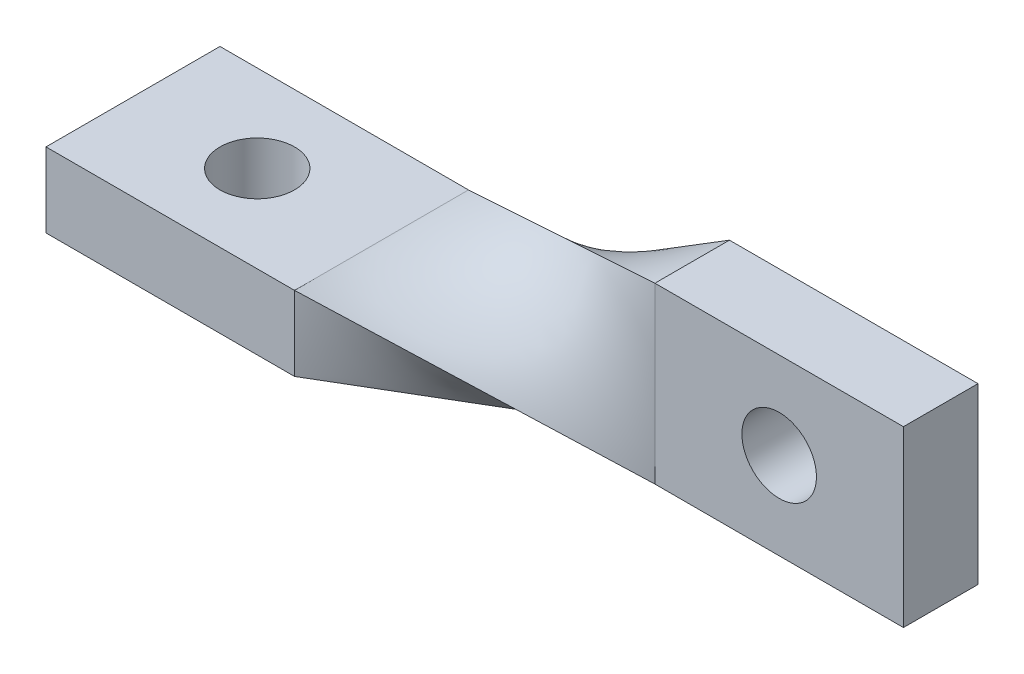
ISO-10303-21;
HEADER;
FILE_DESCRIPTION(('STEP AP214'),'2;1');
FILE_NAME('part.step','',(''),(''),'','','');
FILE_SCHEMA(('AUTOMOTIVE_DESIGN { 1 0 10303 214 1 1 1 1 }'));
ENDSEC;
DATA;
#1=APPLICATION_CONTEXT('core data for automotive mechanical design processes');
#2=APPLICATION_PROTOCOL_DEFINITION('international standard','automotive_design',2000,#1);
#3=PRODUCT_CONTEXT('',#1,'mechanical');
#4=PRODUCT('Part','Part','',(#3));
#5=PRODUCT_RELATED_PRODUCT_CATEGORY('part','',(#4));
#6=PRODUCT_DEFINITION_FORMATION('','',#4);
#7=PRODUCT_DEFINITION_CONTEXT('part definition',#1,'design');
#8=PRODUCT_DEFINITION('design','',#6,#7);
#9=PRODUCT_DEFINITION_SHAPE('','',#8);
#10=(LENGTH_UNIT() NAMED_UNIT(*) SI_UNIT(.MILLI.,.METRE.));
#11=(NAMED_UNIT(*) PLANE_ANGLE_UNIT() SI_UNIT($,.RADIAN.));
#12=(NAMED_UNIT(*) SI_UNIT($,.STERADIAN.) SOLID_ANGLE_UNIT());
#13=UNCERTAINTY_MEASURE_WITH_UNIT(LENGTH_MEASURE(1.E-05),#10,'distance_accuracy_value','');
#14=(GEOMETRIC_REPRESENTATION_CONTEXT(3) GLOBAL_UNCERTAINTY_ASSIGNED_CONTEXT((#13)) GLOBAL_UNIT_ASSIGNED_CONTEXT((#10,
#11,#12)) REPRESENTATION_CONTEXT('',''));
#15=CARTESIAN_POINT('',(0.,0.,0.));
#16=DIRECTION('',(0.,0.,1.));
#17=DIRECTION('',(1.,0.,0.));
#18=AXIS2_PLACEMENT_3D('',#15,#16,#17);
#19=CARTESIAN_POINT('',(9.,3.5,-5.));
#20=CARTESIAN_POINT('',(6.,1.83333333333333,-4.5));
#21=CARTESIAN_POINT('',(3.,0.166666666666668,-4.));
#22=CARTESIAN_POINT('',(0.,-1.5,-3.49999999999999));
#23=CARTESIAN_POINT('',(9.,1.16666666666667,-5.));
#24=CARTESIAN_POINT('',(6.,0.277777777777778,-3.72222222222222));
#25=CARTESIAN_POINT('',(3.,-0.61111111111111,-2.44444444444444));
#26=CARTESIAN_POINT('',(0.,-1.5,-1.16666666666666));
#27=CARTESIAN_POINT('',(9.,-1.16666666666667,-5.));
#28=CARTESIAN_POINT('',(6.,-1.27777777777778,-2.94444444444444));
#29=CARTESIAN_POINT('',(3.,-1.38888888888889,-0.888888888888886));
#30=CARTESIAN_POINT('',(0.,-1.5,1.16666666666667));
#31=CARTESIAN_POINT('',(9.,-3.5,-5.));
#32=CARTESIAN_POINT('',(6.,-2.83333333333333,-2.16666666666667));
#33=CARTESIAN_POINT('',(3.,-2.16666666666667,0.666666666666669));
#34=CARTESIAN_POINT('',(0.,-1.5,3.50000000000001));
#35=B_SPLINE_SURFACE_WITH_KNOTS('',3,3,((#19,#20,#21,#22),(#23,#24,#25,#26),(#27,#28,#29,#30),
(#31,#32,#33,#34)),.UNSPECIFIED.,.F.,.F.,.F.,(4,4),(4,4),(0.,1.),(0.,1.),.UNSPECIFIED.);
#36=DIRECTION('',(0.,1.,0.));
#37=VECTOR('',#36,1.);
#38=CARTESIAN_POINT('',(9.,-3.5,-5.));
#39=LINE('',#38,#37);
#40=CARTESIAN_POINT('',(9.,-3.5,-5.));
#41=VERTEX_POINT('',#40);
#42=CARTESIAN_POINT('',(9.,3.5,-5.));
#43=VERTEX_POINT('',#42);
#44=EDGE_CURVE('E230',#41,#43,#39,.T.);
#45=DIRECTION('',(-0.71770700054601,0.15949044456578,0.677834389404565));
#46=VECTOR('',#45,1.);
#47=CARTESIAN_POINT('',(4.5,-2.5,-0.749999999999999));
#48=LINE('',#47,#46);
#49=CARTESIAN_POINT('',(0.,-1.5,3.50000000000001));
#50=VERTEX_POINT('',#49);
#51=EDGE_CURVE('E96',#41,#50,#48,.T.);
#52=DIRECTION('',(0.,0.,1.));
#53=VECTOR('',#52,1.);
#54=CARTESIAN_POINT('',(0.,-1.5,3.50000000000001));
#55=LINE('',#54,#53);
#56=CARTESIAN_POINT('',(0.,-1.5,-3.49999999999999));
#57=VERTEX_POINT('',#56);
#58=EDGE_CURVE('E88',#57,#50,#55,.T.);
#59=DIRECTION('',(0.865024796397983,0.480569331332212,-0.144170799399664));
#60=VECTOR('',#59,1.);
#61=CARTESIAN_POINT('',(4.5,1.,-4.25));
#62=LINE('',#61,#60);
#63=EDGE_CURVE('E293',#57,#43,#62,.T.);
#64=ORIENTED_EDGE('',*,*,#44,.F.);
#65=ORIENTED_EDGE('',*,*,#51,.T.);
#66=ORIENTED_EDGE('',*,*,#58,.F.);
#67=ORIENTED_EDGE('',*,*,#63,.T.);
#68=EDGE_LOOP('',(#64,#65,#66,#67));
#69=FACE_BOUND('',#68,.T.);
#70=ADVANCED_FACE('F75',(#69),#35,.T.);
#71=CARTESIAN_POINT('',(9.,-3.5,-5.));
#72=CARTESIAN_POINT('',(6.,-2.83333333333333,-2.16666666666667));
#73=CARTESIAN_POINT('',(3.,-2.16666666666667,0.666666666666669));
#74=CARTESIAN_POINT('',(0.,-1.5,3.50000000000001));
#75=CARTESIAN_POINT('',(9.,-3.5,-4.));
#76=CARTESIAN_POINT('',(6.,-2.5,-1.5));
#77=CARTESIAN_POINT('',(3.,-1.5,1.));
#78=CARTESIAN_POINT('',(0.,-0.499999999999998,3.50000000000001));
#79=CARTESIAN_POINT('',(9.,-3.5,-3.));
#80=CARTESIAN_POINT('',(6.,-2.16666666666667,-0.833333333333334));
#81=CARTESIAN_POINT('',(3.,-0.833333333333333,1.33333333333334));
#82=CARTESIAN_POINT('',(0.,0.500000000000002,3.50000000000001));
#83=CARTESIAN_POINT('',(9.,-3.5,-2.));
#84=CARTESIAN_POINT('',(6.,-1.83333333333333,-0.166666666666667));
#85=CARTESIAN_POINT('',(3.,-0.166666666666666,1.66666666666667));
#86=CARTESIAN_POINT('',(0.,1.5,3.50000000000001));
#87=B_SPLINE_SURFACE_WITH_KNOTS('',3,3,((#71,#72,#73,#74),(#75,#76,#77,#78),(#79,#80,#81,#82),
(#83,#84,#85,#86)),.UNSPECIFIED.,.F.,.F.,.F.,(4,4),(4,4),(0.,1.),(0.,1.),.UNSPECIFIED.);
#88=DIRECTION('',(0.,0.,-1.));
#89=VECTOR('',#88,1.);
#90=CARTESIAN_POINT('',(9.,-3.5,-2.));
#91=LINE('',#90,#89);
#92=CARTESIAN_POINT('',(9.,-3.5,-2.));
#93=VERTEX_POINT('',#92);
#94=EDGE_CURVE('E181',#93,#41,#91,.T.);
#95=DIRECTION('',(-0.771035286380614,0.428352936878119,0.471188230565932));
#96=VECTOR('',#95,1.);
#97=CARTESIAN_POINT('',(4.5,-1.,0.750000000000001));
#98=LINE('',#97,#96);
#99=CARTESIAN_POINT('',(0.,1.5,3.50000000000001));
#100=VERTEX_POINT('',#99);
#101=EDGE_CURVE('E314',#93,#100,#98,.T.);
#102=DIRECTION('',(0.,1.,0.));
#103=VECTOR('',#102,1.);
#104=CARTESIAN_POINT('',(0.,-1.5,3.50000000000001));
#105=LINE('',#104,#103);
#106=EDGE_CURVE('E13',#50,#100,#105,.T.);
#107=ORIENTED_EDGE('',*,*,#94,.F.);
#108=ORIENTED_EDGE('',*,*,#101,.T.);
#109=ORIENTED_EDGE('',*,*,#106,.F.);
#110=ORIENTED_EDGE('',*,*,#51,.F.);
#111=EDGE_LOOP('',(#107,#108,#109,#110));
#112=FACE_BOUND('',#111,.T.);
#113=ADVANCED_FACE('F343',(#112),#87,.T.);
#114=CARTESIAN_POINT('',(9.,3.5,-2.));
#115=CARTESIAN_POINT('',(6.,2.83333333333333,-2.5));
#116=CARTESIAN_POINT('',(3.,2.16666666666667,-3.));
#117=CARTESIAN_POINT('',(0.,1.5,-3.49999999999999));
#118=CARTESIAN_POINT('',(9.,3.5,-3.));
#119=CARTESIAN_POINT('',(6.,2.5,-3.16666666666666));
#120=CARTESIAN_POINT('',(3.,1.5,-3.33333333333333));
#121=CARTESIAN_POINT('',(0.,0.500000000000002,-3.49999999999999));
#122=CARTESIAN_POINT('',(9.,3.5,-4.));
#123=CARTESIAN_POINT('',(6.,2.16666666666667,-3.83333333333333));
#124=CARTESIAN_POINT('',(3.,0.833333333333334,-3.66666666666666));
#125=CARTESIAN_POINT('',(0.,-0.499999999999998,-3.49999999999999));
#126=CARTESIAN_POINT('',(9.,3.5,-5.));
#127=CARTESIAN_POINT('',(6.,1.83333333333333,-4.5));
#128=CARTESIAN_POINT('',(3.,0.166666666666668,-4.));
#129=CARTESIAN_POINT('',(0.,-1.5,-3.49999999999999));
#130=B_SPLINE_SURFACE_WITH_KNOTS('',3,3,((#114,#115,#116,#117),(#118,#119,#120,#121),(#122,#123,
#124,#125),(#126,#127,#128,#129)),.UNSPECIFIED.,.F.,.F.,.F.,(4,4),(4,4),(0.,1.),(0.,1.),.UNSPECIFIED.);
#131=DIRECTION('',(0.,0.,1.));
#132=VECTOR('',#131,1.);
#133=CARTESIAN_POINT('',(9.,3.5,-2.));
#134=LINE('',#133,#132);
#135=CARTESIAN_POINT('',(9.,3.5,-2.));
#136=VERTEX_POINT('',#135);
#137=EDGE_CURVE('E221',#43,#136,#134,.T.);
#138=DIRECTION('',(0.,-1.,0.));
#139=VECTOR('',#138,1.);
#140=CARTESIAN_POINT('',(0.,-1.5,-3.49999999999999));
#141=LINE('',#140,#139);
#142=CARTESIAN_POINT('',(0.,1.5,-3.49999999999999));
#143=VERTEX_POINT('',#142);
#144=EDGE_CURVE('E104',#143,#57,#141,.T.);
#145=DIRECTION('',(-0.963517909629941,-0.214115091028875,-0.160586318271657));
#146=VECTOR('',#145,1.);
#147=CARTESIAN_POINT('',(4.5,2.5,-2.75));
#148=LINE('',#147,#146);
#149=EDGE_CURVE('E321',#136,#143,#148,.T.);
#150=ORIENTED_EDGE('',*,*,#137,.F.);
#151=ORIENTED_EDGE('',*,*,#63,.F.);
#152=ORIENTED_EDGE('',*,*,#144,.F.);
#153=ORIENTED_EDGE('',*,*,#149,.F.);
#154=EDGE_LOOP('',(#150,#151,#152,#153));
#155=FACE_BOUND('',#154,.T.);
#156=ADVANCED_FACE('F333',(#155),#130,.T.);
#157=CARTESIAN_POINT('',(9.,-3.5,-2.));
#158=CARTESIAN_POINT('',(6.,-1.83333333333333,-0.166666666666667));
#159=CARTESIAN_POINT('',(3.,-0.166666666666666,1.66666666666667));
#160=CARTESIAN_POINT('',(0.,1.5,3.50000000000001));
#161=CARTESIAN_POINT('',(9.,-1.16666666666667,-2.));
#162=CARTESIAN_POINT('',(6.,-0.277777777777779,-0.944444444444444));
#163=CARTESIAN_POINT('',(3.,0.611111111111111,0.111111111111114));
#164=CARTESIAN_POINT('',(0.,1.5,1.16666666666667));
#165=CARTESIAN_POINT('',(9.,1.16666666666666,-2.));
#166=CARTESIAN_POINT('',(6.,1.27777777777778,-1.72222222222222));
#167=CARTESIAN_POINT('',(3.,1.38888888888889,-1.44444444444444));
#168=CARTESIAN_POINT('',(0.,1.5,-1.16666666666666));
#169=CARTESIAN_POINT('',(9.,3.5,-2.));
#170=CARTESIAN_POINT('',(6.,2.83333333333333,-2.5));
#171=CARTESIAN_POINT('',(3.,2.16666666666667,-3.));
#172=CARTESIAN_POINT('',(0.,1.5,-3.49999999999999));
#173=B_SPLINE_SURFACE_WITH_KNOTS('',3,3,((#157,#158,#159,#160),(#161,#162,#163,#164),(#165,#166,
#167,#168),(#169,#170,#171,#172)),.UNSPECIFIED.,.F.,.F.,.F.,(4,4),(4,4),(0.,1.),(0.,1.),.UNSPECIFIED.);
#174=DIRECTION('',(0.,-1.,0.));
#175=VECTOR('',#174,1.);
#176=CARTESIAN_POINT('',(9.,-3.5,-2.));
#177=LINE('',#176,#175);
#178=EDGE_CURVE('E229',#136,#93,#177,.T.);
#179=DIRECTION('',(0.,0.,-1.));
#180=VECTOR('',#179,1.);
#181=CARTESIAN_POINT('',(0.,1.5,3.50000000000001));
#182=LINE('',#181,#180);
#183=EDGE_CURVE('E82',#100,#143,#182,.T.);
#184=ORIENTED_EDGE('',*,*,#178,.F.);
#185=ORIENTED_EDGE('',*,*,#149,.T.);
#186=ORIENTED_EDGE('',*,*,#183,.F.);
#187=ORIENTED_EDGE('',*,*,#101,.F.);
#188=EDGE_LOOP('',(#184,#185,#186,#187));
#189=FACE_BOUND('',#188,.T.);
#190=ADVANCED_FACE('F77',(#189),#173,.T.);
#191=CARTESIAN_POINT('',(19.,3.5,-2.));
#192=DIRECTION('',(0.,0.,-1.));
#193=DIRECTION('',(0.,1.,0.));
#194=AXIS2_PLACEMENT_3D('',#191,#192,#193);
#195=PLANE('',#194);
#196=CARTESIAN_POINT('',(14.,0.,-2.));
#197=DIRECTION('',(0.,0.,1.));
#198=DIRECTION('',(1.,0.,0.));
#199=AXIS2_PLACEMENT_3D('',#196,#197,#198);
#200=CIRCLE('',#199,1.5);
#201=CARTESIAN_POINT('',(15.5,0.,-2.));
#202=VERTEX_POINT('',#201);
#203=EDGE_CURVE('E559',#202,#202,#200,.T.);
#204=ORIENTED_EDGE('',*,*,#203,.F.);
#205=EDGE_LOOP('',(#204));
#206=FACE_BOUND('',#205,.T.);
#207=ORIENTED_EDGE('',*,*,#178,.T.);
#208=DIRECTION('',(-1.,0.,0.));
#209=VECTOR('',#208,1.);
#210=CARTESIAN_POINT('',(19.,-3.5,-2.));
#211=LINE('',#210,#209);
#212=CARTESIAN_POINT('',(19.,-3.5,-2.));
#213=VERTEX_POINT('',#212);
#214=EDGE_CURVE('E252',#213,#93,#211,.T.);
#215=ORIENTED_EDGE('',*,*,#214,.F.);
#216=DIRECTION('',(0.,-1.,0.));
#217=VECTOR('',#216,1.);
#218=CARTESIAN_POINT('',(19.,3.5,-2.));
#219=LINE('',#218,#217);
#220=CARTESIAN_POINT('',(19.,3.5,-2.));
#221=VERTEX_POINT('',#220);
#222=EDGE_CURVE('E172',#221,#213,#219,.T.);
#223=ORIENTED_EDGE('',*,*,#222,.F.);
#224=DIRECTION('',(-1.,0.,0.));
#225=VECTOR('',#224,1.);
#226=CARTESIAN_POINT('',(19.,3.5,-2.));
#227=LINE('',#226,#225);
#228=EDGE_CURVE('E294',#221,#136,#227,.T.);
#229=ORIENTED_EDGE('',*,*,#228,.T.);
#230=EDGE_LOOP('',(#207,#215,#223,#229));
#231=FACE_BOUND('',#230,.T.);
#232=ADVANCED_FACE('F271',(#206,#231),#195,.F.);
#233=CARTESIAN_POINT('',(19.,-3.5,-2.));
#234=DIRECTION('',(0.,1.,0.));
#235=DIRECTION('',(0.,0.,1.));
#236=AXIS2_PLACEMENT_3D('',#233,#234,#235);
#237=PLANE('',#236);
#238=ORIENTED_EDGE('',*,*,#94,.T.);
#239=DIRECTION('',(-1.,0.,0.));
#240=VECTOR('',#239,1.);
#241=CARTESIAN_POINT('',(19.,-3.5,-5.));
#242=LINE('',#241,#240);
#243=CARTESIAN_POINT('',(19.,-3.5,-5.));
#244=VERTEX_POINT('',#243);
#245=EDGE_CURVE('E249',#244,#41,#242,.T.);
#246=ORIENTED_EDGE('',*,*,#245,.F.);
#247=DIRECTION('',(0.,0.,-1.));
#248=VECTOR('',#247,1.);
#249=CARTESIAN_POINT('',(19.,-3.5,-2.));
#250=LINE('',#249,#248);
#251=EDGE_CURVE('E175',#213,#244,#250,.T.);
#252=ORIENTED_EDGE('',*,*,#251,.F.);
#253=ORIENTED_EDGE('',*,*,#214,.T.);
#254=EDGE_LOOP('',(#238,#246,#252,#253));
#255=FACE_BOUND('',#254,.T.);
#256=ADVANCED_FACE('F262',(#255),#237,.F.);
#257=CARTESIAN_POINT('',(19.,-3.5,-5.));
#258=DIRECTION('',(0.,0.,1.));
#259=DIRECTION('',(0.,-1.,0.));
#260=AXIS2_PLACEMENT_3D('',#257,#258,#259);
#261=PLANE('',#260);
#262=CARTESIAN_POINT('',(14.,0.,-5.));
#263=DIRECTION('',(0.,0.,1.));
#264=DIRECTION('',(0.,-1.,0.));
#265=AXIS2_PLACEMENT_3D('',#262,#263,#264);
#266=CIRCLE('',#265,1.5);
#267=CARTESIAN_POINT('',(14.,-1.50000000000001,-5.));
#268=VERTEX_POINT('',#267);
#269=EDGE_CURVE('E562',#268,#268,#266,.F.);
#270=ORIENTED_EDGE('',*,*,#269,.F.);
#271=EDGE_LOOP('',(#270));
#272=FACE_BOUND('',#271,.T.);
#273=ORIENTED_EDGE('',*,*,#44,.T.);
#274=DIRECTION('',(-1.,0.,0.));
#275=VECTOR('',#274,1.);
#276=CARTESIAN_POINT('',(19.,3.5,-5.));
#277=LINE('',#276,#275);
#278=CARTESIAN_POINT('',(19.,3.5,-5.));
#279=VERTEX_POINT('',#278);
#280=EDGE_CURVE('E231',#279,#43,#277,.T.);
#281=ORIENTED_EDGE('',*,*,#280,.F.);
#282=DIRECTION('',(0.,1.,0.));
#283=VECTOR('',#282,1.);
#284=CARTESIAN_POINT('',(19.,-3.5,-5.));
#285=LINE('',#284,#283);
#286=EDGE_CURVE('E302',#244,#279,#285,.T.);
#287=ORIENTED_EDGE('',*,*,#286,.F.);
#288=ORIENTED_EDGE('',*,*,#245,.T.);
#289=EDGE_LOOP('',(#273,#281,#287,#288));
#290=FACE_BOUND('',#289,.T.);
#291=ADVANCED_FACE('F210',(#272,#290),#261,.F.);
#292=CARTESIAN_POINT('',(19.,3.5,-5.));
#293=DIRECTION('',(0.,-1.,0.));
#294=DIRECTION('',(0.,0.,-1.));
#295=AXIS2_PLACEMENT_3D('',#292,#293,#294);
#296=PLANE('',#295);
#297=ORIENTED_EDGE('',*,*,#137,.T.);
#298=ORIENTED_EDGE('',*,*,#228,.F.);
#299=DIRECTION('',(0.,0.,1.));
#300=VECTOR('',#299,1.);
#301=CARTESIAN_POINT('',(19.,3.5,-5.));
#302=LINE('',#301,#300);
#303=EDGE_CURVE('E296',#279,#221,#302,.T.);
#304=ORIENTED_EDGE('',*,*,#303,.F.);
#305=ORIENTED_EDGE('',*,*,#280,.T.);
#306=EDGE_LOOP('',(#297,#298,#304,#305));
#307=FACE_BOUND('',#306,.T.);
#308=ADVANCED_FACE('F205',(#307),#296,.F.);
#309=CARTESIAN_POINT('',(19.,0.,0.));
#310=DIRECTION('',(1.,0.,0.));
#311=DIRECTION('',(0.,0.,-1.));
#312=AXIS2_PLACEMENT_3D('',#309,#310,#311);
#313=PLANE('',#312);
#314=ORIENTED_EDGE('',*,*,#222,.T.);
#315=ORIENTED_EDGE('',*,*,#251,.T.);
#316=ORIENTED_EDGE('',*,*,#286,.T.);
#317=ORIENTED_EDGE('',*,*,#303,.T.);
#318=EDGE_LOOP('',(#314,#315,#316,#317));
#319=FACE_BOUND('',#318,.T.);
#320=ADVANCED_FACE('F200',(#319),#313,.T.);
#321=CARTESIAN_POINT('',(-10.,-1.5,3.50000000000001));
#322=DIRECTION('',(0.,0.,-1.));
#323=DIRECTION('',(-1.,0.,0.));
#324=AXIS2_PLACEMENT_3D('',#321,#322,#323);
#325=PLANE('',#324);
#326=ORIENTED_EDGE('',*,*,#106,.T.);
#327=DIRECTION('',(1.,0.,0.));
#328=VECTOR('',#327,1.);
#329=CARTESIAN_POINT('',(-10.,1.5,3.50000000000001));
#330=LINE('',#329,#328);
#331=CARTESIAN_POINT('',(-10.,1.5,3.50000000000001));
#332=VERTEX_POINT('',#331);
#333=EDGE_CURVE('E153',#332,#100,#330,.T.);
#334=ORIENTED_EDGE('',*,*,#333,.F.);
#335=DIRECTION('',(0.,1.,0.));
#336=VECTOR('',#335,1.);
#337=CARTESIAN_POINT('',(-10.,-1.5,3.50000000000001));
#338=LINE('',#337,#336);
#339=CARTESIAN_POINT('',(-10.,-1.5,3.50000000000001));
#340=VERTEX_POINT('',#339);
#341=EDGE_CURVE('E159',#340,#332,#338,.T.);
#342=ORIENTED_EDGE('',*,*,#341,.F.);
#343=DIRECTION('',(1.,0.,0.));
#344=VECTOR('',#343,1.);
#345=CARTESIAN_POINT('',(-10.,-1.5,3.50000000000001));
#346=LINE('',#345,#344);
#347=EDGE_CURVE('E383',#340,#50,#346,.T.);
#348=ORIENTED_EDGE('',*,*,#347,.T.);
#349=EDGE_LOOP('',(#326,#334,#342,#348));
#350=FACE_BOUND('',#349,.T.);
#351=ADVANCED_FACE('F170',(#350),#325,.F.);
#352=CARTESIAN_POINT('',(-10.,1.5,3.50000000000001));
#353=DIRECTION('',(0.,-1.,0.));
#354=DIRECTION('',(0.,0.,-1.));
#355=AXIS2_PLACEMENT_3D('',#352,#353,#354);
#356=PLANE('',#355);
#357=CARTESIAN_POINT('',(-5.,1.5,0.));
#358=DIRECTION('',(0.,1.,0.));
#359=DIRECTION('',(0.,0.,1.));
#360=AXIS2_PLACEMENT_3D('',#357,#358,#359);
#361=CIRCLE('',#360,1.5);
#362=CARTESIAN_POINT('',(-5.,1.5,1.50000000000001));
#363=VERTEX_POINT('',#362);
#364=EDGE_CURVE('E563',#363,#363,#361,.T.);
#365=ORIENTED_EDGE('',*,*,#364,.F.);
#366=EDGE_LOOP('',(#365));
#367=FACE_BOUND('',#366,.T.);
#368=ORIENTED_EDGE('',*,*,#183,.T.);
#369=DIRECTION('',(1.,0.,0.));
#370=VECTOR('',#369,1.);
#371=CARTESIAN_POINT('',(-10.,1.5,-3.49999999999999));
#372=LINE('',#371,#370);
#373=CARTESIAN_POINT('',(-10.,1.5,-3.49999999999999));
#374=VERTEX_POINT('',#373);
#375=EDGE_CURVE('E155',#374,#143,#372,.T.);
#376=ORIENTED_EDGE('',*,*,#375,.F.);
#377=DIRECTION('',(0.,0.,-1.));
#378=VECTOR('',#377,1.);
#379=CARTESIAN_POINT('',(-10.,1.5,3.50000000000001));
#380=LINE('',#379,#378);
#381=EDGE_CURVE('E148',#332,#374,#380,.T.);
#382=ORIENTED_EDGE('',*,*,#381,.F.);
#383=ORIENTED_EDGE('',*,*,#333,.T.);
#384=EDGE_LOOP('',(#368,#376,#382,#383));
#385=FACE_BOUND('',#384,.T.);
#386=ADVANCED_FACE('F151',(#367,#385),#356,.F.);
#387=CARTESIAN_POINT('',(-10.,1.5,-3.49999999999999));
#388=DIRECTION('',(0.,0.,1.));
#389=DIRECTION('',(1.,0.,0.));
#390=AXIS2_PLACEMENT_3D('',#387,#388,#389);
#391=PLANE('',#390);
#392=ORIENTED_EDGE('',*,*,#144,.T.);
#393=DIRECTION('',(1.,0.,0.));
#394=VECTOR('',#393,1.);
#395=CARTESIAN_POINT('',(-10.,-1.5,-3.49999999999999));
#396=LINE('',#395,#394);
#397=CARTESIAN_POINT('',(-10.,-1.5,-3.49999999999999));
#398=VERTEX_POINT('',#397);
#399=EDGE_CURVE('E177',#398,#57,#396,.T.);
#400=ORIENTED_EDGE('',*,*,#399,.F.);
#401=DIRECTION('',(0.,-1.,0.));
#402=VECTOR('',#401,1.);
#403=CARTESIAN_POINT('',(-10.,1.5,-3.49999999999999));
#404=LINE('',#403,#402);
#405=EDGE_CURVE('E158',#374,#398,#404,.T.);
#406=ORIENTED_EDGE('',*,*,#405,.F.);
#407=ORIENTED_EDGE('',*,*,#375,.T.);
#408=EDGE_LOOP('',(#392,#400,#406,#407));
#409=FACE_BOUND('',#408,.T.);
#410=ADVANCED_FACE('F378',(#409),#391,.F.);
#411=CARTESIAN_POINT('',(-10.,-1.5,-3.49999999999999));
#412=DIRECTION('',(0.,1.,0.));
#413=DIRECTION('',(0.,0.,1.));
#414=AXIS2_PLACEMENT_3D('',#411,#412,#413);
#415=PLANE('',#414);
#416=CARTESIAN_POINT('',(-5.,-1.5,0.));
#417=DIRECTION('',(0.,1.,0.));
#418=DIRECTION('',(0.,0.,1.));
#419=AXIS2_PLACEMENT_3D('',#416,#417,#418);
#420=CIRCLE('',#419,1.5);
#421=CARTESIAN_POINT('',(-5.,-1.5,1.50000000000001));
#422=VERTEX_POINT('',#421);
#423=EDGE_CURVE('E168',#422,#422,#420,.F.);
#424=ORIENTED_EDGE('',*,*,#423,.F.);
#425=EDGE_LOOP('',(#424));
#426=FACE_BOUND('',#425,.T.);
#427=ORIENTED_EDGE('',*,*,#58,.T.);
#428=ORIENTED_EDGE('',*,*,#347,.F.);
#429=DIRECTION('',(0.,0.,1.));
#430=VECTOR('',#429,1.);
#431=CARTESIAN_POINT('',(-10.,-1.5,-3.49999999999999));
#432=LINE('',#431,#430);
#433=EDGE_CURVE('E164',#398,#340,#432,.T.);
#434=ORIENTED_EDGE('',*,*,#433,.F.);
#435=ORIENTED_EDGE('',*,*,#399,.T.);
#436=EDGE_LOOP('',(#427,#428,#434,#435));
#437=FACE_BOUND('',#436,.T.);
#438=ADVANCED_FACE('F382',(#426,#437),#415,.F.);
#439=CARTESIAN_POINT('',(-10.,0.,0.));
#440=DIRECTION('',(-1.,0.,0.));
#441=DIRECTION('',(0.,0.,1.));
#442=AXIS2_PLACEMENT_3D('',#439,#440,#441);
#443=PLANE('',#442);
#444=ORIENTED_EDGE('',*,*,#341,.T.);
#445=ORIENTED_EDGE('',*,*,#381,.T.);
#446=ORIENTED_EDGE('',*,*,#405,.T.);
#447=ORIENTED_EDGE('',*,*,#433,.T.);
#448=EDGE_LOOP('',(#444,#445,#446,#447));
#449=FACE_BOUND('',#448,.T.);
#450=ADVANCED_FACE('F162',(#449),#443,.T.);
#451=CARTESIAN_POINT('',(-5.,-3.5011,0.));
#452=DIRECTION('',(0.,1.,0.));
#453=DIRECTION('',(0.,0.,1.));
#454=AXIS2_PLACEMENT_3D('',#451,#452,#453);
#455=CYLINDRICAL_SURFACE('',#454,1.5);
#456=ORIENTED_EDGE('',*,*,#364,.T.);
#457=EDGE_LOOP('',(#456));
#458=FACE_BOUND('',#457,.T.);
#459=ORIENTED_EDGE('',*,*,#423,.T.);
#460=EDGE_LOOP('',(#459));
#461=FACE_BOUND('',#460,.T.);
#462=ADVANCED_FACE('F504',(#458,#461),#455,.F.);
#463=CARTESIAN_POINT('',(14.,0.,-5.0011));
#464=DIRECTION('',(0.,0.,1.));
#465=DIRECTION('',(1.,0.,0.));
#466=AXIS2_PLACEMENT_3D('',#463,#464,#465);
#467=CYLINDRICAL_SURFACE('',#466,1.5);
#468=ORIENTED_EDGE('',*,*,#203,.T.);
#469=EDGE_LOOP('',(#468));
#470=FACE_BOUND('',#469,.T.);
#471=ORIENTED_EDGE('',*,*,#269,.T.);
#472=EDGE_LOOP('',(#471));
#473=FACE_BOUND('',#472,.T.);
#474=ADVANCED_FACE('F525',(#470,#473),#467,.F.);
#475=CLOSED_SHELL('',(#70,#113,#156,#190,#232,#256,#291,#308,#320,#351,#386,#410,#438,#450,#462,#474));
#476=MANIFOLD_SOLID_BREP('B2',#475);
#477=ADVANCED_BREP_SHAPE_REPRESENTATION('',(#18,#476),#14);
#478=SHAPE_DEFINITION_REPRESENTATION(#9,#477);
ENDSEC;
END-ISO-10303-21;
